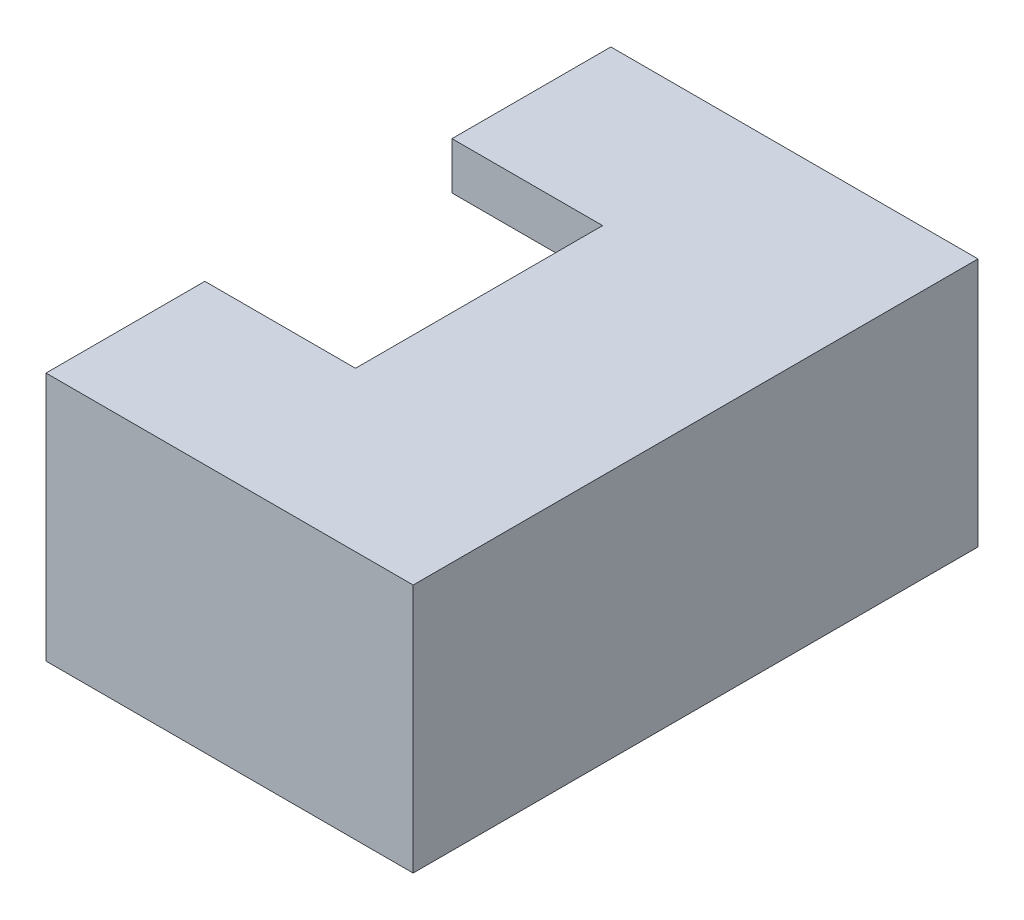
ISO-10303-21;
HEADER;
FILE_DESCRIPTION(('STEP AP214'),'2;1');
FILE_NAME('part.step','',(''),(''),'','','');
FILE_SCHEMA(('AUTOMOTIVE_DESIGN { 1 0 10303 214 1 1 1 1 }'));
ENDSEC;
DATA;
#1=APPLICATION_CONTEXT('core data for automotive mechanical design processes');
#2=APPLICATION_PROTOCOL_DEFINITION('international standard','automotive_design',2000,#1);
#3=PRODUCT_CONTEXT('',#1,'mechanical');
#4=PRODUCT('Part','Part','',(#3));
#5=PRODUCT_RELATED_PRODUCT_CATEGORY('part','',(#4));
#6=PRODUCT_DEFINITION_FORMATION('','',#4);
#7=PRODUCT_DEFINITION_CONTEXT('part definition',#1,'design');
#8=PRODUCT_DEFINITION('design','',#6,#7);
#9=PRODUCT_DEFINITION_SHAPE('','',#8);
#10=(LENGTH_UNIT() NAMED_UNIT(*) SI_UNIT(.MILLI.,.METRE.));
#11=(NAMED_UNIT(*) PLANE_ANGLE_UNIT() SI_UNIT($,.RADIAN.));
#12=(NAMED_UNIT(*) SI_UNIT($,.STERADIAN.) SOLID_ANGLE_UNIT());
#13=UNCERTAINTY_MEASURE_WITH_UNIT(LENGTH_MEASURE(1.E-05),#10,'distance_accuracy_value','');
#14=(GEOMETRIC_REPRESENTATION_CONTEXT(3) GLOBAL_UNCERTAINTY_ASSIGNED_CONTEXT((#13)) GLOBAL_UNIT_ASSIGNED_CONTEXT((#10,
#11,#12)) REPRESENTATION_CONTEXT('',''));
#15=CARTESIAN_POINT('',(0.,0.,0.));
#16=DIRECTION('',(0.,0.,1.));
#17=DIRECTION('',(1.,0.,0.));
#18=AXIS2_PLACEMENT_3D('',#15,#16,#17);
#19=CARTESIAN_POINT('',(7.55,3.4,-3.3));
#20=DIRECTION('',(1.,0.,0.));
#21=DIRECTION('',(0.,0.,-1.));
#22=AXIS2_PLACEMENT_3D('',#19,#20,#21);
#23=PLANE('',#22);
#24=DIRECTION('',(0.,-1.,0.));
#25=VECTOR('',#24,1.);
#26=CARTESIAN_POINT('',(7.55,3.4,-3.6));
#27=LINE('',#26,#25);
#28=CARTESIAN_POINT('',(7.55,3.4,-3.6));
#29=VERTEX_POINT('',#28);
#30=CARTESIAN_POINT('',(7.55,3.1,-3.6));
#31=VERTEX_POINT('',#30);
#32=EDGE_CURVE('P0_E96',#29,#31,#27,.T.);
#33=ORIENTED_EDGE('',*,*,#32,.F.);
#34=DIRECTION('',(0.,0.,-1.));
#35=VECTOR('',#34,1.);
#36=CARTESIAN_POINT('',(7.55,3.4,-3.3));
#37=LINE('',#36,#35);
#38=CARTESIAN_POINT('',(7.55,3.4,-3.3));
#39=VERTEX_POINT('',#38);
#40=EDGE_CURVE('P0_E11',#39,#29,#37,.T.);
#41=ORIENTED_EDGE('',*,*,#40,.F.);
#42=DIRECTION('',(0.,-1.,0.));
#43=VECTOR('',#42,1.);
#44=CARTESIAN_POINT('',(7.55,3.4,-3.3));
#45=LINE('',#44,#43);
#46=CARTESIAN_POINT('',(7.55,3.1,-3.3));
#47=VERTEX_POINT('',#46);
#48=EDGE_CURVE('P0_E90',#39,#47,#45,.T.);
#49=ORIENTED_EDGE('',*,*,#48,.T.);
#50=DIRECTION('',(0.,0.,-1.));
#51=VECTOR('',#50,1.);
#52=CARTESIAN_POINT('',(7.55,3.1,-3.3));
#53=LINE('',#52,#51);
#54=EDGE_CURVE('P0_E35',#47,#31,#53,.T.);
#55=ORIENTED_EDGE('',*,*,#54,.T.);
#56=EDGE_LOOP('',(#33,#41,#49,#55));
#57=FACE_BOUND('',#56,.T.);
#58=ADVANCED_FACE('P0_F32',(#57),#23,.T.);
#59=CARTESIAN_POINT('',(3.55,3.4,-3.3));
#60=DIRECTION('',(0.,1.,0.));
#61=DIRECTION('',(0.,0.,1.));
#62=AXIS2_PLACEMENT_3D('',#59,#60,#61);
#63=PLANE('',#62);
#64=DIRECTION('',(1.,0.,0.));
#65=VECTOR('',#64,1.);
#66=CARTESIAN_POINT('',(3.55,3.4,-3.6));
#67=LINE('',#66,#65);
#68=CARTESIAN_POINT('',(3.55,3.4,-3.6));
#69=VERTEX_POINT('',#68);
#70=EDGE_CURVE('P0_E92',#69,#29,#67,.T.);
#71=ORIENTED_EDGE('',*,*,#70,.F.);
#72=DIRECTION('',(0.,0.,-1.));
#73=VECTOR('',#72,1.);
#74=CARTESIAN_POINT('',(3.55,3.4,-3.3));
#75=LINE('',#74,#73);
#76=CARTESIAN_POINT('',(3.55,3.4,-3.3));
#77=VERTEX_POINT('',#76);
#78=EDGE_CURVE('P0_E41',#77,#69,#75,.T.);
#79=ORIENTED_EDGE('',*,*,#78,.F.);
#80=DIRECTION('',(1.,0.,0.));
#81=VECTOR('',#80,1.);
#82=CARTESIAN_POINT('',(3.55,3.4,-3.3));
#83=LINE('',#82,#81);
#84=EDGE_CURVE('P0_E87',#77,#39,#83,.T.);
#85=ORIENTED_EDGE('',*,*,#84,.T.);
#86=ORIENTED_EDGE('',*,*,#40,.T.);
#87=EDGE_LOOP('',(#71,#79,#85,#86));
#88=FACE_BOUND('',#87,.T.);
#89=ADVANCED_FACE('P0_F106',(#88),#63,.T.);
#90=CARTESIAN_POINT('',(3.55,3.1,-3.3));
#91=DIRECTION('',(-1.,0.,0.));
#92=DIRECTION('',(0.,0.,1.));
#93=AXIS2_PLACEMENT_3D('',#90,#91,#92);
#94=PLANE('',#93);
#95=DIRECTION('',(0.,1.,0.));
#96=VECTOR('',#95,1.);
#97=CARTESIAN_POINT('',(3.55,3.1,-3.6));
#98=LINE('',#97,#96);
#99=CARTESIAN_POINT('',(3.55,3.1,-3.6));
#100=VERTEX_POINT('',#99);
#101=EDGE_CURVE('P0_E82',#100,#69,#98,.T.);
#102=ORIENTED_EDGE('',*,*,#101,.F.);
#103=DIRECTION('',(0.,0.,-1.));
#104=VECTOR('',#103,1.);
#105=CARTESIAN_POINT('',(3.55,3.1,-3.3));
#106=LINE('',#105,#104);
#107=CARTESIAN_POINT('',(3.55,3.1,-3.3));
#108=VERTEX_POINT('',#107);
#109=EDGE_CURVE('P0_E77',#108,#100,#106,.T.);
#110=ORIENTED_EDGE('',*,*,#109,.F.);
#111=DIRECTION('',(0.,1.,0.));
#112=VECTOR('',#111,1.);
#113=CARTESIAN_POINT('',(3.55,3.1,-3.3));
#114=LINE('',#113,#112);
#115=EDGE_CURVE('P0_E80',#108,#77,#114,.T.);
#116=ORIENTED_EDGE('',*,*,#115,.T.);
#117=ORIENTED_EDGE('',*,*,#78,.T.);
#118=EDGE_LOOP('',(#102,#110,#116,#117));
#119=FACE_BOUND('',#118,.T.);
#120=ADVANCED_FACE('P0_F79',(#119),#94,.T.);
#121=CARTESIAN_POINT('',(7.55,3.1,-3.3));
#122=DIRECTION('',(0.,-1.,0.));
#123=DIRECTION('',(0.,0.,-1.));
#124=AXIS2_PLACEMENT_3D('',#121,#122,#123);
#125=PLANE('',#124);
#126=DIRECTION('',(-1.,0.,0.));
#127=VECTOR('',#126,1.);
#128=CARTESIAN_POINT('',(7.55,3.1,-3.6));
#129=LINE('',#128,#127);
#130=EDGE_CURVE('P0_E99',#31,#100,#129,.T.);
#131=ORIENTED_EDGE('',*,*,#130,.F.);
#132=ORIENTED_EDGE('',*,*,#54,.F.);
#133=DIRECTION('',(-1.,0.,0.));
#134=VECTOR('',#133,1.);
#135=CARTESIAN_POINT('',(7.55,3.1,-3.3));
#136=LINE('',#135,#134);
#137=EDGE_CURVE('P0_E86',#47,#108,#136,.T.);
#138=ORIENTED_EDGE('',*,*,#137,.T.);
#139=ORIENTED_EDGE('',*,*,#109,.T.);
#140=EDGE_LOOP('',(#131,#132,#138,#139));
#141=FACE_BOUND('',#140,.T.);
#142=ADVANCED_FACE('P0_F89',(#141),#125,.T.);
#143=CARTESIAN_POINT('',(0.,0.,-3.3));
#144=DIRECTION('',(0.,0.,-1.));
#145=DIRECTION('',(-1.,0.,0.));
#146=AXIS2_PLACEMENT_3D('',#143,#144,#145);
#147=PLANE('',#146);
#148=ORIENTED_EDGE('',*,*,#48,.F.);
#149=ORIENTED_EDGE('',*,*,#84,.F.);
#150=ORIENTED_EDGE('',*,*,#115,.F.);
#151=ORIENTED_EDGE('',*,*,#137,.F.);
#152=EDGE_LOOP('',(#148,#149,#150,#151));
#153=FACE_BOUND('',#152,.T.);
#154=ADVANCED_FACE('P0_F85',(#153),#147,.F.);
#155=CARTESIAN_POINT('',(0.,0.,-3.6));
#156=DIRECTION('',(0.,0.,-1.));
#157=DIRECTION('',(-1.,0.,0.));
#158=AXIS2_PLACEMENT_3D('',#155,#156,#157);
#159=PLANE('',#158);
#160=ORIENTED_EDGE('',*,*,#32,.T.);
#161=ORIENTED_EDGE('',*,*,#130,.T.);
#162=ORIENTED_EDGE('',*,*,#101,.T.);
#163=ORIENTED_EDGE('',*,*,#70,.T.);
#164=EDGE_LOOP('',(#160,#161,#162,#163));
#165=FACE_BOUND('',#164,.T.);
#166=ADVANCED_FACE('P0_F105',(#165),#159,.T.);
#167=CLOSED_SHELL('',(#58,#89,#120,#142,#154,#166));
#168=MANIFOLD_SOLID_BREP('P0_B2',#167);
#169=CARTESIAN_POINT('',(7.55,5.55,-5.5));
#170=DIRECTION('',(0.,1.,0.));
#171=DIRECTION('',(0.,0.,1.));
#172=AXIS2_PLACEMENT_3D('',#169,#170,#171);
#173=PLANE('',#172);
#174=DIRECTION('',(-1.,0.,0.));
#175=VECTOR('',#174,1.);
#176=CARTESIAN_POINT('',(7.55,5.55,-5.5));
#177=LINE('',#176,#175);
#178=CARTESIAN_POINT('',(1.45,5.55,-5.5));
#179=VERTEX_POINT('',#178);
#180=CARTESIAN_POINT('',(7.55,5.55,-5.5));
#181=VERTEX_POINT('',#180);
#182=EDGE_CURVE('P1_E175',#179,#181,#177,.F.);
#183=ORIENTED_EDGE('',*,*,#182,.T.);
#184=DIRECTION('',(0.,0.,-1.));
#185=VECTOR('',#184,1.);
#186=CARTESIAN_POINT('',(7.55,5.55,0.));
#187=LINE('',#186,#185);
#188=CARTESIAN_POINT('',(7.55,5.55,-5.));
#189=VERTEX_POINT('',#188);
#190=EDGE_CURVE('P1_E150',#181,#189,#187,.F.);
#191=ORIENTED_EDGE('',*,*,#190,.T.);
#192=DIRECTION('',(1.,0.,0.));
#193=VECTOR('',#192,1.);
#194=CARTESIAN_POINT('',(7.55,5.55,-5.));
#195=LINE('',#194,#193);
#196=CARTESIAN_POINT('',(1.45,5.55,-5.));
#197=VERTEX_POINT('',#196);
#198=EDGE_CURVE('P1_E160',#189,#197,#195,.F.);
#199=ORIENTED_EDGE('',*,*,#198,.T.);
#200=DIRECTION('',(0.,0.,1.));
#201=VECTOR('',#200,1.);
#202=CARTESIAN_POINT('',(1.45,5.55,-5.5));
#203=LINE('',#202,#201);
#204=EDGE_CURVE('P1_E19',#179,#197,#203,.T.);
#205=ORIENTED_EDGE('',*,*,#204,.F.);
#206=EDGE_LOOP('',(#183,#191,#199,#205));
#207=FACE_BOUND('',#206,.T.);
#208=ADVANCED_FACE('P1_F16',(#207),#173,.F.);
#209=CARTESIAN_POINT('',(7.55,5.55,5.5));
#210=DIRECTION('',(0.,1.,0.));
#211=DIRECTION('',(0.,0.,1.));
#212=AXIS2_PLACEMENT_3D('',#209,#210,#211);
#213=PLANE('',#212);
#214=DIRECTION('',(-1.,0.,0.));
#215=VECTOR('',#214,1.);
#216=CARTESIAN_POINT('',(7.55,5.55,5.));
#217=LINE('',#216,#215);
#218=CARTESIAN_POINT('',(1.45,5.55,5.));
#219=VERTEX_POINT('',#218);
#220=CARTESIAN_POINT('',(7.55,5.55,5.));
#221=VERTEX_POINT('',#220);
#222=EDGE_CURVE('P1_E126',#219,#221,#217,.F.);
#223=ORIENTED_EDGE('',*,*,#222,.T.);
#224=DIRECTION('',(0.,0.,-1.));
#225=VECTOR('',#224,1.);
#226=CARTESIAN_POINT('',(7.55,5.55,0.));
#227=LINE('',#226,#225);
#228=CARTESIAN_POINT('',(7.55,5.55,5.5));
#229=VERTEX_POINT('',#228);
#230=EDGE_CURVE('P1_E155',#221,#229,#227,.F.);
#231=ORIENTED_EDGE('',*,*,#230,.T.);
#232=DIRECTION('',(1.,0.,0.));
#233=VECTOR('',#232,1.);
#234=CARTESIAN_POINT('',(7.55,5.55,5.5));
#235=LINE('',#234,#233);
#236=CARTESIAN_POINT('',(1.45,5.55,5.5));
#237=VERTEX_POINT('',#236);
#238=EDGE_CURVE('P1_E132',#229,#237,#235,.F.);
#239=ORIENTED_EDGE('',*,*,#238,.T.);
#240=DIRECTION('',(0.,0.,1.));
#241=VECTOR('',#240,1.);
#242=CARTESIAN_POINT('',(1.45,5.55,5.5));
#243=LINE('',#242,#241);
#244=EDGE_CURVE('P1_E129',#219,#237,#243,.T.);
#245=ORIENTED_EDGE('',*,*,#244,.F.);
#246=EDGE_LOOP('',(#223,#231,#239,#245));
#247=FACE_BOUND('',#246,.T.);
#248=ADVANCED_FACE('P1_F130',(#247),#213,.F.);
#249=CARTESIAN_POINT('',(7.55,5.55,5.));
#250=DIRECTION('',(0.,0.,-1.));
#251=DIRECTION('',(-1.,0.,0.));
#252=AXIS2_PLACEMENT_3D('',#249,#250,#251);
#253=PLANE('',#252);
#254=DIRECTION('',(1.,0.,0.));
#255=VECTOR('',#254,1.);
#256=CARTESIAN_POINT('',(7.55,5.05,5.));
#257=LINE('',#256,#255);
#258=CARTESIAN_POINT('',(1.45,5.05,5.));
#259=VERTEX_POINT('',#258);
#260=CARTESIAN_POINT('',(7.55,5.05,5.));
#261=VERTEX_POINT('',#260);
#262=EDGE_CURVE('P1_E201',#259,#261,#257,.T.);
#263=ORIENTED_EDGE('',*,*,#262,.T.);
#264=DIRECTION('',(0.,1.,0.));
#265=VECTOR('',#264,1.);
#266=CARTESIAN_POINT('',(7.55,0.,5.));
#267=LINE('',#266,#265);
#268=EDGE_CURVE('P1_E143',#261,#221,#267,.T.);
#269=ORIENTED_EDGE('',*,*,#268,.T.);
#270=ORIENTED_EDGE('',*,*,#222,.F.);
#271=DIRECTION('',(0.,1.,0.));
#272=VECTOR('',#271,1.);
#273=CARTESIAN_POINT('',(1.45,5.55,5.));
#274=LINE('',#273,#272);
#275=EDGE_CURVE('P1_E141',#259,#219,#274,.T.);
#276=ORIENTED_EDGE('',*,*,#275,.F.);
#277=EDGE_LOOP('',(#263,#269,#270,#276));
#278=FACE_BOUND('',#277,.T.);
#279=ADVANCED_FACE('P1_F140',(#278),#253,.F.);
#280=CARTESIAN_POINT('',(7.55,0.,0.));
#281=DIRECTION('',(1.,0.,0.));
#282=DIRECTION('',(0.,0.,-1.));
#283=AXIS2_PLACEMENT_3D('',#280,#281,#282);
#284=PLANE('',#283);
#285=DIRECTION('',(0.,0.,-1.));
#286=VECTOR('',#285,1.);
#287=CARTESIAN_POINT('',(7.55,1.25,-5.5));
#288=LINE('',#287,#286);
#289=CARTESIAN_POINT('',(7.55,1.25,-5.5));
#290=VERTEX_POINT('',#289);
#291=CARTESIAN_POINT('',(7.55,1.25,5.5));
#292=VERTEX_POINT('',#291);
#293=EDGE_CURVE('P1_E183',#290,#292,#288,.F.);
#294=ORIENTED_EDGE('',*,*,#293,.T.);
#295=DIRECTION('',(0.,1.,0.));
#296=VECTOR('',#295,1.);
#297=CARTESIAN_POINT('',(7.55,5.05,5.5));
#298=LINE('',#297,#296);
#299=EDGE_CURVE('P1_E188',#292,#229,#298,.T.);
#300=ORIENTED_EDGE('',*,*,#299,.T.);
#301=ORIENTED_EDGE('',*,*,#230,.F.);
#302=ORIENTED_EDGE('',*,*,#268,.F.);
#303=DIRECTION('',(0.,0.,1.));
#304=VECTOR('',#303,1.);
#305=CARTESIAN_POINT('',(7.55,5.05,-5.));
#306=LINE('',#305,#304);
#307=CARTESIAN_POINT('',(7.55,5.05,-5.));
#308=VERTEX_POINT('',#307);
#309=EDGE_CURVE('P1_E203',#261,#308,#306,.F.);
#310=ORIENTED_EDGE('',*,*,#309,.T.);
#311=DIRECTION('',(0.,1.,0.));
#312=VECTOR('',#311,1.);
#313=CARTESIAN_POINT('',(7.55,5.55,-5.));
#314=LINE('',#313,#312);
#315=EDGE_CURVE('P1_E157',#308,#189,#314,.T.);
#316=ORIENTED_EDGE('',*,*,#315,.T.);
#317=ORIENTED_EDGE('',*,*,#190,.F.);
#318=DIRECTION('',(0.,1.,0.));
#319=VECTOR('',#318,1.);
#320=CARTESIAN_POINT('',(7.55,5.05,-5.5));
#321=LINE('',#320,#319);
#322=EDGE_CURVE('P1_E178',#181,#290,#321,.F.);
#323=ORIENTED_EDGE('',*,*,#322,.T.);
#324=EDGE_LOOP('',(#294,#300,#301,#302,#310,#316,#317,#323));
#325=FACE_BOUND('',#324,.T.);
#326=ADVANCED_FACE('P1_F320',(#325),#284,.F.);
#327=CARTESIAN_POINT('',(7.55,5.55,-5.));
#328=DIRECTION('',(0.,0.,1.));
#329=DIRECTION('',(1.,0.,0.));
#330=AXIS2_PLACEMENT_3D('',#327,#328,#329);
#331=PLANE('',#330);
#332=ORIENTED_EDGE('',*,*,#198,.F.);
#333=ORIENTED_EDGE('',*,*,#315,.F.);
#334=DIRECTION('',(1.,0.,0.));
#335=VECTOR('',#334,1.);
#336=CARTESIAN_POINT('',(7.55,5.05,-5.));
#337=LINE('',#336,#335);
#338=CARTESIAN_POINT('',(1.45,5.05,-5.));
#339=VERTEX_POINT('',#338);
#340=EDGE_CURVE('P1_E206',#308,#339,#337,.F.);
#341=ORIENTED_EDGE('',*,*,#340,.T.);
#342=DIRECTION('',(0.,1.,0.));
#343=VECTOR('',#342,1.);
#344=CARTESIAN_POINT('',(1.45,5.55,-5.));
#345=LINE('',#344,#343);
#346=EDGE_CURVE('P1_E163',#197,#339,#345,.F.);
#347=ORIENTED_EDGE('',*,*,#346,.F.);
#348=EDGE_LOOP('',(#332,#333,#341,#347));
#349=FACE_BOUND('',#348,.T.);
#350=ADVANCED_FACE('P1_F316',(#349),#331,.F.);
#351=CARTESIAN_POINT('',(1.45,1.75,-2.625));
#352=DIRECTION('',(0.,0.,-1.));
#353=DIRECTION('',(-1.,0.,0.));
#354=AXIS2_PLACEMENT_3D('',#351,#352,#353);
#355=PLANE('',#354);
#356=DIRECTION('',(1.,0.,0.));
#357=VECTOR('',#356,1.);
#358=CARTESIAN_POINT('',(7.55,5.05,-2.625));
#359=LINE('',#358,#357);
#360=CARTESIAN_POINT('',(1.45,5.05,-2.625));
#361=VERTEX_POINT('',#360);
#362=CARTESIAN_POINT('',(4.65,5.05,-2.625));
#363=VERTEX_POINT('',#362);
#364=EDGE_CURVE('P1_E192',#361,#363,#359,.T.);
#365=ORIENTED_EDGE('',*,*,#364,.T.);
#366=DIRECTION('',(0.,1.,0.));
#367=VECTOR('',#366,1.);
#368=CARTESIAN_POINT('',(4.65,1.75,-2.625));
#369=LINE('',#368,#367);
#370=CARTESIAN_POINT('',(4.65,6.05,-2.625));
#371=VERTEX_POINT('',#370);
#372=EDGE_CURVE('P1_E167',#363,#371,#369,.T.);
#373=ORIENTED_EDGE('',*,*,#372,.T.);
#374=DIRECTION('',(1.,0.,0.));
#375=VECTOR('',#374,1.);
#376=CARTESIAN_POINT('',(0.,6.05,-2.625));
#377=LINE('',#376,#375);
#378=CARTESIAN_POINT('',(1.45,6.05,-2.625));
#379=VERTEX_POINT('',#378);
#380=EDGE_CURVE('P1_E209',#379,#371,#377,.T.);
#381=ORIENTED_EDGE('',*,*,#380,.F.);
#382=DIRECTION('',(0.,1.,0.));
#383=VECTOR('',#382,1.);
#384=CARTESIAN_POINT('',(1.45,1.75,-2.625));
#385=LINE('',#384,#383);
#386=EDGE_CURVE('P1_E165',#361,#379,#385,.T.);
#387=ORIENTED_EDGE('',*,*,#386,.F.);
#388=EDGE_LOOP('',(#365,#373,#381,#387));
#389=FACE_BOUND('',#388,.T.);
#390=ADVANCED_FACE('P1_F312',(#389),#355,.F.);
#391=CARTESIAN_POINT('',(4.65,1.75,-2.625));
#392=DIRECTION('',(1.,0.,0.));
#393=DIRECTION('',(0.,0.,-1.));
#394=AXIS2_PLACEMENT_3D('',#391,#392,#393);
#395=PLANE('',#394);
#396=DIRECTION('',(0.,0.,1.));
#397=VECTOR('',#396,1.);
#398=CARTESIAN_POINT('',(4.65,5.05,-5.));
#399=LINE('',#398,#397);
#400=CARTESIAN_POINT('',(4.65,5.05,2.625));
#401=VERTEX_POINT('',#400);
#402=EDGE_CURVE('P1_E195',#363,#401,#399,.T.);
#403=ORIENTED_EDGE('',*,*,#402,.T.);
#404=DIRECTION('',(0.,1.,0.));
#405=VECTOR('',#404,1.);
#406=CARTESIAN_POINT('',(4.65,1.75,2.625));
#407=LINE('',#406,#405);
#408=CARTESIAN_POINT('',(4.65,6.05,2.625));
#409=VERTEX_POINT('',#408);
#410=EDGE_CURVE('P1_E172',#401,#409,#407,.T.);
#411=ORIENTED_EDGE('',*,*,#410,.T.);
#412=DIRECTION('',(0.,0.,1.));
#413=VECTOR('',#412,1.);
#414=CARTESIAN_POINT('',(4.65,6.05,0.));
#415=LINE('',#414,#413);
#416=EDGE_CURVE('P1_E211',#371,#409,#415,.T.);
#417=ORIENTED_EDGE('',*,*,#416,.F.);
#418=ORIENTED_EDGE('',*,*,#372,.F.);
#419=EDGE_LOOP('',(#403,#411,#417,#418));
#420=FACE_BOUND('',#419,.T.);
#421=ADVANCED_FACE('P1_F308',(#420),#395,.F.);
#422=CARTESIAN_POINT('',(1.45,1.75,2.625));
#423=DIRECTION('',(0.,0.,1.));
#424=DIRECTION('',(1.,0.,0.));
#425=AXIS2_PLACEMENT_3D('',#422,#423,#424);
#426=PLANE('',#425);
#427=DIRECTION('',(1.,0.,0.));
#428=VECTOR('',#427,1.);
#429=CARTESIAN_POINT('',(7.55,5.05,2.625));
#430=LINE('',#429,#428);
#431=CARTESIAN_POINT('',(1.45,5.05,2.625));
#432=VERTEX_POINT('',#431);
#433=EDGE_CURVE('P1_E198',#401,#432,#430,.F.);
#434=ORIENTED_EDGE('',*,*,#433,.T.);
#435=DIRECTION('',(0.,1.,0.));
#436=VECTOR('',#435,1.);
#437=CARTESIAN_POINT('',(1.45,1.75,2.625));
#438=LINE('',#437,#436);
#439=CARTESIAN_POINT('',(1.45,6.05,2.625));
#440=VERTEX_POINT('',#439);
#441=EDGE_CURVE('P1_E170',#440,#432,#438,.F.);
#442=ORIENTED_EDGE('',*,*,#441,.F.);
#443=DIRECTION('',(1.,0.,0.));
#444=VECTOR('',#443,1.);
#445=CARTESIAN_POINT('',(0.,6.05,2.625));
#446=LINE('',#445,#444);
#447=EDGE_CURVE('P1_E213',#409,#440,#446,.F.);
#448=ORIENTED_EDGE('',*,*,#447,.F.);
#449=ORIENTED_EDGE('',*,*,#410,.F.);
#450=EDGE_LOOP('',(#434,#442,#448,#449));
#451=FACE_BOUND('',#450,.T.);
#452=ADVANCED_FACE('P1_F304',(#451),#426,.F.);
#453=CARTESIAN_POINT('',(7.55,5.05,-5.5));
#454=DIRECTION('',(0.,0.,-1.));
#455=DIRECTION('',(-1.,0.,0.));
#456=AXIS2_PLACEMENT_3D('',#453,#454,#455);
#457=PLANE('',#456);
#458=DIRECTION('',(1.,0.,0.));
#459=VECTOR('',#458,1.);
#460=CARTESIAN_POINT('',(7.55,1.25,-5.5));
#461=LINE('',#460,#459);
#462=CARTESIAN_POINT('',(1.45,1.25,-5.5));
#463=VERTEX_POINT('',#462);
#464=EDGE_CURVE('P1_E180',#463,#290,#461,.T.);
#465=ORIENTED_EDGE('',*,*,#464,.T.);
#466=ORIENTED_EDGE('',*,*,#322,.F.);
#467=ORIENTED_EDGE('',*,*,#182,.F.);
#468=DIRECTION('',(0.,1.,0.));
#469=VECTOR('',#468,1.);
#470=CARTESIAN_POINT('',(1.45,6.05,-5.5));
#471=LINE('',#470,#469);
#472=EDGE_CURVE('P1_E218',#179,#463,#471,.F.);
#473=ORIENTED_EDGE('',*,*,#472,.T.);
#474=EDGE_LOOP('',(#465,#466,#467,#473));
#475=FACE_BOUND('',#474,.T.);
#476=ADVANCED_FACE('P1_F300',(#475),#457,.F.);
#477=CARTESIAN_POINT('',(7.55,1.25,-5.5));
#478=DIRECTION('',(0.,-1.,0.));
#479=DIRECTION('',(0.,0.,-1.));
#480=AXIS2_PLACEMENT_3D('',#477,#478,#479);
#481=PLANE('',#480);
#482=DIRECTION('',(1.,0.,0.));
#483=VECTOR('',#482,1.);
#484=CARTESIAN_POINT('',(7.55,1.25,5.5));
#485=LINE('',#484,#483);
#486=CARTESIAN_POINT('',(1.45,1.25,5.5));
#487=VERTEX_POINT('',#486);
#488=EDGE_CURVE('P1_E185',#487,#292,#485,.T.);
#489=ORIENTED_EDGE('',*,*,#488,.T.);
#490=ORIENTED_EDGE('',*,*,#293,.F.);
#491=ORIENTED_EDGE('',*,*,#464,.F.);
#492=DIRECTION('',(0.,0.,-1.));
#493=VECTOR('',#492,1.);
#494=CARTESIAN_POINT('',(1.45,1.25,-6.));
#495=LINE('',#494,#493);
#496=EDGE_CURVE('P1_E221',#463,#487,#495,.F.);
#497=ORIENTED_EDGE('',*,*,#496,.T.);
#498=EDGE_LOOP('',(#489,#490,#491,#497));
#499=FACE_BOUND('',#498,.T.);
#500=ADVANCED_FACE('P1_F296',(#499),#481,.F.);
#501=CARTESIAN_POINT('',(7.55,5.05,5.5));
#502=DIRECTION('',(0.,0.,1.));
#503=DIRECTION('',(1.,0.,0.));
#504=AXIS2_PLACEMENT_3D('',#501,#502,#503);
#505=PLANE('',#504);
#506=ORIENTED_EDGE('',*,*,#238,.F.);
#507=ORIENTED_EDGE('',*,*,#299,.F.);
#508=ORIENTED_EDGE('',*,*,#488,.F.);
#509=DIRECTION('',(0.,1.,0.));
#510=VECTOR('',#509,1.);
#511=CARTESIAN_POINT('',(1.45,6.05,5.5));
#512=LINE('',#511,#510);
#513=EDGE_CURVE('P1_E224',#487,#237,#512,.T.);
#514=ORIENTED_EDGE('',*,*,#513,.T.);
#515=EDGE_LOOP('',(#506,#507,#508,#514));
#516=FACE_BOUND('',#515,.T.);
#517=ADVANCED_FACE('P1_F292',(#516),#505,.F.);
#518=CARTESIAN_POINT('',(7.55,5.05,-5.));
#519=DIRECTION('',(0.,1.,0.));
#520=DIRECTION('',(0.,0.,1.));
#521=AXIS2_PLACEMENT_3D('',#518,#519,#520);
#522=PLANE('',#521);
#523=ORIENTED_EDGE('',*,*,#340,.F.);
#524=ORIENTED_EDGE('',*,*,#309,.F.);
#525=ORIENTED_EDGE('',*,*,#262,.F.);
#526=DIRECTION('',(0.,0.,-1.));
#527=VECTOR('',#526,1.);
#528=CARTESIAN_POINT('',(1.45,5.05,-6.));
#529=LINE('',#528,#527);
#530=EDGE_CURVE('P1_E149',#259,#432,#529,.T.);
#531=ORIENTED_EDGE('',*,*,#530,.T.);
#532=ORIENTED_EDGE('',*,*,#433,.F.);
#533=ORIENTED_EDGE('',*,*,#402,.F.);
#534=ORIENTED_EDGE('',*,*,#364,.F.);
#535=DIRECTION('',(0.,0.,-1.));
#536=VECTOR('',#535,1.);
#537=CARTESIAN_POINT('',(1.45,5.05,-6.));
#538=LINE('',#537,#536);
#539=EDGE_CURVE('P1_E235',#361,#339,#538,.T.);
#540=ORIENTED_EDGE('',*,*,#539,.T.);
#541=EDGE_LOOP('',(#523,#524,#525,#531,#532,#533,#534,#540));
#542=FACE_BOUND('',#541,.T.);
#543=ADVANCED_FACE('P1_F288',(#542),#522,.F.);
#544=CARTESIAN_POINT('',(0.,6.05,0.));
#545=DIRECTION('',(0.,1.,0.));
#546=DIRECTION('',(0.,0.,1.));
#547=AXIS2_PLACEMENT_3D('',#544,#545,#546);
#548=PLANE('',#547);
#549=DIRECTION('',(1.,0.,0.));
#550=VECTOR('',#549,1.);
#551=CARTESIAN_POINT('',(1.45,6.05,-6.));
#552=LINE('',#551,#550);
#553=CARTESIAN_POINT('',(9.25,6.05,-6.));
#554=VERTEX_POINT('',#553);
#555=CARTESIAN_POINT('',(1.45,6.05,-6.));
#556=VERTEX_POINT('',#555);
#557=EDGE_CURVE('P1_E216',#554,#556,#552,.F.);
#558=ORIENTED_EDGE('',*,*,#557,.T.);
#559=DIRECTION('',(0.,0.,-1.));
#560=VECTOR('',#559,1.);
#561=CARTESIAN_POINT('',(1.45,6.05,-6.));
#562=LINE('',#561,#560);
#563=EDGE_CURVE('P1_E232',#556,#379,#562,.F.);
#564=ORIENTED_EDGE('',*,*,#563,.T.);
#565=ORIENTED_EDGE('',*,*,#380,.T.);
#566=ORIENTED_EDGE('',*,*,#416,.T.);
#567=ORIENTED_EDGE('',*,*,#447,.T.);
#568=DIRECTION('',(0.,0.,-1.));
#569=VECTOR('',#568,1.);
#570=CARTESIAN_POINT('',(1.45,6.05,-6.));
#571=LINE('',#570,#569);
#572=CARTESIAN_POINT('',(1.45,6.05,6.));
#573=VERTEX_POINT('',#572);
#574=EDGE_CURVE('P1_E227',#440,#573,#571,.F.);
#575=ORIENTED_EDGE('',*,*,#574,.T.);
#576=DIRECTION('',(-1.,0.,0.));
#577=VECTOR('',#576,1.);
#578=CARTESIAN_POINT('',(1.45,6.05,6.));
#579=LINE('',#578,#577);
#580=CARTESIAN_POINT('',(9.25,6.05,6.));
#581=VERTEX_POINT('',#580);
#582=EDGE_CURVE('P1_E241',#573,#581,#579,.F.);
#583=ORIENTED_EDGE('',*,*,#582,.T.);
#584=DIRECTION('',(0.,0.,1.));
#585=VECTOR('',#584,1.);
#586=CARTESIAN_POINT('',(9.25,6.05,-6.));
#587=LINE('',#586,#585);
#588=EDGE_CURVE('P1_E244',#581,#554,#587,.F.);
#589=ORIENTED_EDGE('',*,*,#588,.T.);
#590=EDGE_LOOP('',(#558,#564,#565,#566,#567,#575,#583,#589));
#591=FACE_BOUND('',#590,.T.);
#592=ADVANCED_FACE('P1_F285',(#591),#548,.T.);
#593=CARTESIAN_POINT('',(1.45,6.05,-6.));
#594=DIRECTION('',(0.,0.,1.));
#595=DIRECTION('',(1.,0.,0.));
#596=AXIS2_PLACEMENT_3D('',#593,#594,#595);
#597=PLANE('',#596);
#598=DIRECTION('',(0.,1.,0.));
#599=VECTOR('',#598,1.);
#600=CARTESIAN_POINT('',(1.45,6.05,-6.));
#601=LINE('',#600,#599);
#602=CARTESIAN_POINT('',(1.45,0.75,-6.));
#603=VERTEX_POINT('',#602);
#604=EDGE_CURVE('P1_E229',#603,#556,#601,.T.);
#605=ORIENTED_EDGE('',*,*,#604,.T.);
#606=ORIENTED_EDGE('',*,*,#557,.F.);
#607=DIRECTION('',(0.,1.,0.));
#608=VECTOR('',#607,1.);
#609=CARTESIAN_POINT('',(9.25,6.05,-6.));
#610=LINE('',#609,#608);
#611=CARTESIAN_POINT('',(9.25,0.75,-6.));
#612=VERTEX_POINT('',#611);
#613=EDGE_CURVE('P1_E247',#554,#612,#610,.F.);
#614=ORIENTED_EDGE('',*,*,#613,.T.);
#615=DIRECTION('',(1.,0.,0.));
#616=VECTOR('',#615,1.);
#617=CARTESIAN_POINT('',(0.,0.75,-6.));
#618=LINE('',#617,#616);
#619=EDGE_CURVE('P1_E250',#612,#603,#618,.F.);
#620=ORIENTED_EDGE('',*,*,#619,.T.);
#621=EDGE_LOOP('',(#605,#606,#614,#620));
#622=FACE_BOUND('',#621,.T.);
#623=ADVANCED_FACE('P1_F267',(#622),#597,.F.);
#624=CARTESIAN_POINT('',(1.45,6.05,-6.));
#625=DIRECTION('',(1.,0.,0.));
#626=DIRECTION('',(0.,0.,-1.));
#627=AXIS2_PLACEMENT_3D('',#624,#625,#626);
#628=PLANE('',#627);
#629=ORIENTED_EDGE('',*,*,#539,.F.);
#630=ORIENTED_EDGE('',*,*,#386,.T.);
#631=ORIENTED_EDGE('',*,*,#563,.F.);
#632=ORIENTED_EDGE('',*,*,#604,.F.);
#633=DIRECTION('',(0.,0.,1.));
#634=VECTOR('',#633,1.);
#635=CARTESIAN_POINT('',(1.45,0.75,0.));
#636=LINE('',#635,#634);
#637=CARTESIAN_POINT('',(1.45,0.75,6.));
#638=VERTEX_POINT('',#637);
#639=EDGE_CURVE('P1_E253',#603,#638,#636,.T.);
#640=ORIENTED_EDGE('',*,*,#639,.T.);
#641=DIRECTION('',(0.,1.,0.));
#642=VECTOR('',#641,1.);
#643=CARTESIAN_POINT('',(1.45,6.05,6.));
#644=LINE('',#643,#642);
#645=EDGE_CURVE('P1_E238',#638,#573,#644,.T.);
#646=ORIENTED_EDGE('',*,*,#645,.T.);
#647=ORIENTED_EDGE('',*,*,#574,.F.);
#648=ORIENTED_EDGE('',*,*,#441,.T.);
#649=ORIENTED_EDGE('',*,*,#530,.F.);
#650=ORIENTED_EDGE('',*,*,#275,.T.);
#651=ORIENTED_EDGE('',*,*,#244,.T.);
#652=ORIENTED_EDGE('',*,*,#513,.F.);
#653=ORIENTED_EDGE('',*,*,#496,.F.);
#654=ORIENTED_EDGE('',*,*,#472,.F.);
#655=ORIENTED_EDGE('',*,*,#204,.T.);
#656=ORIENTED_EDGE('',*,*,#346,.T.);
#657=EDGE_LOOP('',(#629,#630,#631,#632,#640,#646,#647,#648,#649,#650,#651,#652,#653,#654,#655,#656));
#658=FACE_BOUND('',#657,.T.);
#659=ADVANCED_FACE('P1_F147',(#658),#628,.F.);
#660=CARTESIAN_POINT('',(1.45,6.05,6.));
#661=DIRECTION('',(0.,0.,-1.));
#662=DIRECTION('',(-1.,0.,0.));
#663=AXIS2_PLACEMENT_3D('',#660,#661,#662);
#664=PLANE('',#663);
#665=DIRECTION('',(0.,1.,0.));
#666=VECTOR('',#665,1.);
#667=CARTESIAN_POINT('',(9.25,6.05,6.));
#668=LINE('',#667,#666);
#669=CARTESIAN_POINT('',(9.25,0.75,6.));
#670=VERTEX_POINT('',#669);
#671=EDGE_CURVE('P1_E33',#670,#581,#668,.T.);
#672=ORIENTED_EDGE('',*,*,#671,.T.);
#673=ORIENTED_EDGE('',*,*,#582,.F.);
#674=ORIENTED_EDGE('',*,*,#645,.F.);
#675=DIRECTION('',(1.,0.,0.));
#676=VECTOR('',#675,1.);
#677=CARTESIAN_POINT('',(0.,0.75,6.));
#678=LINE('',#677,#676);
#679=EDGE_CURVE('P1_E25',#638,#670,#678,.T.);
#680=ORIENTED_EDGE('',*,*,#679,.T.);
#681=EDGE_LOOP('',(#672,#673,#674,#680));
#682=FACE_BOUND('',#681,.T.);
#683=ADVANCED_FACE('P1_F259',(#682),#664,.F.);
#684=CARTESIAN_POINT('',(9.25,6.05,-6.));
#685=DIRECTION('',(-1.,0.,0.));
#686=DIRECTION('',(0.,0.,1.));
#687=AXIS2_PLACEMENT_3D('',#684,#685,#686);
#688=PLANE('',#687);
#689=ORIENTED_EDGE('',*,*,#613,.F.);
#690=ORIENTED_EDGE('',*,*,#588,.F.);
#691=ORIENTED_EDGE('',*,*,#671,.F.);
#692=DIRECTION('',(0.,0.,1.));
#693=VECTOR('',#692,1.);
#694=CARTESIAN_POINT('',(9.25,0.75,0.));
#695=LINE('',#694,#693);
#696=EDGE_CURVE('P1_E11',#670,#612,#695,.F.);
#697=ORIENTED_EDGE('',*,*,#696,.T.);
#698=EDGE_LOOP('',(#689,#690,#691,#697));
#699=FACE_BOUND('',#698,.T.);
#700=ADVANCED_FACE('P1_F269',(#699),#688,.F.);
#701=CARTESIAN_POINT('',(0.,0.75,0.));
#702=DIRECTION('',(0.,1.,0.));
#703=DIRECTION('',(0.,0.,1.));
#704=AXIS2_PLACEMENT_3D('',#701,#702,#703);
#705=PLANE('',#704);
#706=ORIENTED_EDGE('',*,*,#679,.F.);
#707=ORIENTED_EDGE('',*,*,#639,.F.);
#708=ORIENTED_EDGE('',*,*,#619,.F.);
#709=ORIENTED_EDGE('',*,*,#696,.F.);
#710=EDGE_LOOP('',(#706,#707,#708,#709));
#711=FACE_BOUND('',#710,.T.);
#712=ADVANCED_FACE('P1_F263',(#711),#705,.F.);
#713=CLOSED_SHELL('',(#208,#248,#279,#326,#350,#390,#421,#452,#476,#500,#517,#543,#592,#623,
#659,#683,#700,#712));
#714=MANIFOLD_SOLID_BREP('P1_B1',#713);
#715=CARTESIAN_POINT('',(3.55000000000001,3.4,3.3));
#716=DIRECTION('',(0.,-1.,0.));
#717=DIRECTION('',(0.,0.,-1.));
#718=AXIS2_PLACEMENT_3D('',#715,#716,#717);
#719=PLANE('',#718);
#720=DIRECTION('',(1.,0.,0.));
#721=VECTOR('',#720,1.);
#722=CARTESIAN_POINT('',(3.55000000000001,3.4,3.3));
#723=LINE('',#722,#721);
#724=CARTESIAN_POINT('',(7.55,3.4,3.3));
#725=VERTEX_POINT('',#724);
#726=CARTESIAN_POINT('',(3.55000000000001,3.4,3.3));
#727=VERTEX_POINT('',#726);
#728=EDGE_CURVE('P2_E64',#725,#727,#723,.F.);
#729=ORIENTED_EDGE('',*,*,#728,.T.);
#730=DIRECTION('',(0.,0.,1.));
#731=VECTOR('',#730,1.);
#732=CARTESIAN_POINT('',(3.55000000000001,3.4,0.));
#733=LINE('',#732,#731);
#734=CARTESIAN_POINT('',(3.55000000000001,3.4,3.6));
#735=VERTEX_POINT('',#734);
#736=EDGE_CURVE('P2_E54',#735,#727,#733,.F.);
#737=ORIENTED_EDGE('',*,*,#736,.F.);
#738=DIRECTION('',(-1.,0.,0.));
#739=VECTOR('',#738,1.);
#740=CARTESIAN_POINT('',(3.55000000000001,3.4,3.6));
#741=LINE('',#740,#739);
#742=CARTESIAN_POINT('',(7.55,3.4,3.6));
#743=VERTEX_POINT('',#742);
#744=EDGE_CURVE('P2_E74',#735,#743,#741,.F.);
#745=ORIENTED_EDGE('',*,*,#744,.T.);
#746=DIRECTION('',(0.,0.,-1.));
#747=VECTOR('',#746,1.);
#748=CARTESIAN_POINT('',(7.55,3.4,3.3));
#749=LINE('',#748,#747);
#750=EDGE_CURVE('P2_E19',#725,#743,#749,.F.);
#751=ORIENTED_EDGE('',*,*,#750,.F.);
#752=EDGE_LOOP('',(#729,#737,#745,#751));
#753=FACE_BOUND('',#752,.T.);
#754=ADVANCED_FACE('P2_F16',(#753),#719,.F.);
#755=CARTESIAN_POINT('',(3.55000000000001,3.4,3.3));
#756=DIRECTION('',(0.,0.,1.));
#757=DIRECTION('',(1.,0.,0.));
#758=AXIS2_PLACEMENT_3D('',#755,#756,#757);
#759=PLANE('',#758);
#760=DIRECTION('',(1.,0.,0.));
#761=VECTOR('',#760,1.);
#762=CARTESIAN_POINT('',(3.55000000000001,3.1,3.3));
#763=LINE('',#762,#761);
#764=CARTESIAN_POINT('',(7.55,3.1,3.3));
#765=VERTEX_POINT('',#764);
#766=CARTESIAN_POINT('',(3.55000000000001,3.1,3.3));
#767=VERTEX_POINT('',#766);
#768=EDGE_CURVE('P2_E72',#765,#767,#763,.F.);
#769=ORIENTED_EDGE('',*,*,#768,.T.);
#770=DIRECTION('',(0.,1.,0.));
#771=VECTOR('',#770,1.);
#772=CARTESIAN_POINT('',(3.55000000000001,0.,3.3));
#773=LINE('',#772,#771);
#774=EDGE_CURVE('P2_E61',#727,#767,#773,.F.);
#775=ORIENTED_EDGE('',*,*,#774,.F.);
#776=ORIENTED_EDGE('',*,*,#728,.F.);
#777=DIRECTION('',(0.,1.,0.));
#778=VECTOR('',#777,1.);
#779=CARTESIAN_POINT('',(7.55,0.,3.3));
#780=LINE('',#779,#778);
#781=EDGE_CURVE('P2_E78',#725,#765,#780,.F.);
#782=ORIENTED_EDGE('',*,*,#781,.T.);
#783=EDGE_LOOP('',(#769,#775,#776,#782));
#784=FACE_BOUND('',#783,.T.);
#785=ADVANCED_FACE('P2_F71',(#784),#759,.F.);
#786=CARTESIAN_POINT('',(3.55000000000001,0.,0.));
#787=DIRECTION('',(-1.,0.,0.));
#788=DIRECTION('',(0.,0.,1.));
#789=AXIS2_PLACEMENT_3D('',#786,#787,#788);
#790=PLANE('',#789);
#791=ORIENTED_EDGE('',*,*,#774,.T.);
#792=DIRECTION('',(0.,0.,1.));
#793=VECTOR('',#792,1.);
#794=CARTESIAN_POINT('',(3.55000000000001,3.1,3.3));
#795=LINE('',#794,#793);
#796=CARTESIAN_POINT('',(3.55000000000001,3.1,3.6));
#797=VERTEX_POINT('',#796);
#798=EDGE_CURVE('P2_E82',#767,#797,#795,.T.);
#799=ORIENTED_EDGE('',*,*,#798,.T.);
#800=DIRECTION('',(0.,1.,0.));
#801=VECTOR('',#800,1.);
#802=CARTESIAN_POINT('',(3.55000000000001,3.4,3.6));
#803=LINE('',#802,#801);
#804=EDGE_CURVE('P2_E63',#797,#735,#803,.T.);
#805=ORIENTED_EDGE('',*,*,#804,.T.);
#806=ORIENTED_EDGE('',*,*,#736,.T.);
#807=EDGE_LOOP('',(#791,#799,#805,#806));
#808=FACE_BOUND('',#807,.T.);
#809=ADVANCED_FACE('P2_F58',(#808),#790,.T.);
#810=CARTESIAN_POINT('',(3.55000000000001,3.4,3.6));
#811=DIRECTION('',(0.,0.,-1.));
#812=DIRECTION('',(-1.,0.,0.));
#813=AXIS2_PLACEMENT_3D('',#810,#811,#812);
#814=PLANE('',#813);
#815=ORIENTED_EDGE('',*,*,#744,.F.);
#816=ORIENTED_EDGE('',*,*,#804,.F.);
#817=DIRECTION('',(1.,0.,0.));
#818=VECTOR('',#817,1.);
#819=CARTESIAN_POINT('',(3.55000000000001,3.1,3.6));
#820=LINE('',#819,#818);
#821=CARTESIAN_POINT('',(7.55,3.1,3.6));
#822=VERTEX_POINT('',#821);
#823=EDGE_CURVE('P2_E25',#797,#822,#820,.T.);
#824=ORIENTED_EDGE('',*,*,#823,.T.);
#825=DIRECTION('',(0.,1.,0.));
#826=VECTOR('',#825,1.);
#827=CARTESIAN_POINT('',(7.55,0.,3.6));
#828=LINE('',#827,#826);
#829=EDGE_CURVE('P2_E33',#822,#743,#828,.T.);
#830=ORIENTED_EDGE('',*,*,#829,.T.);
#831=EDGE_LOOP('',(#815,#816,#824,#830));
#832=FACE_BOUND('',#831,.T.);
#833=ADVANCED_FACE('P2_F87',(#832),#814,.F.);
#834=CARTESIAN_POINT('',(7.55,0.,0.));
#835=DIRECTION('',(-1.,0.,0.));
#836=DIRECTION('',(0.,0.,1.));
#837=AXIS2_PLACEMENT_3D('',#834,#835,#836);
#838=PLANE('',#837);
#839=DIRECTION('',(0.,0.,1.));
#840=VECTOR('',#839,1.);
#841=CARTESIAN_POINT('',(7.55,3.1,3.3));
#842=LINE('',#841,#840);
#843=EDGE_CURVE('P2_E11',#822,#765,#842,.F.);
#844=ORIENTED_EDGE('',*,*,#843,.T.);
#845=ORIENTED_EDGE('',*,*,#781,.F.);
#846=ORIENTED_EDGE('',*,*,#750,.T.);
#847=ORIENTED_EDGE('',*,*,#829,.F.);
#848=EDGE_LOOP('',(#844,#845,#846,#847));
#849=FACE_BOUND('',#848,.T.);
#850=ADVANCED_FACE('P2_F90',(#849),#838,.F.);
#851=CARTESIAN_POINT('',(3.55000000000001,3.1,3.3));
#852=DIRECTION('',(0.,1.,0.));
#853=DIRECTION('',(0.,0.,1.));
#854=AXIS2_PLACEMENT_3D('',#851,#852,#853);
#855=PLANE('',#854);
#856=ORIENTED_EDGE('',*,*,#823,.F.);
#857=ORIENTED_EDGE('',*,*,#798,.F.);
#858=ORIENTED_EDGE('',*,*,#768,.F.);
#859=ORIENTED_EDGE('',*,*,#843,.F.);
#860=EDGE_LOOP('',(#856,#857,#858,#859));
#861=FACE_BOUND('',#860,.T.);
#862=ADVANCED_FACE('P2_F89',(#861),#855,.F.);
#863=CLOSED_SHELL('',(#754,#785,#809,#833,#850,#862));
#864=MANIFOLD_SOLID_BREP('P2_B1',#863);
#865=CARTESIAN_POINT('',(3.55,3.4,1.));
#866=DIRECTION('',(0.,-1.,0.));
#867=DIRECTION('',(0.,0.,-1.));
#868=AXIS2_PLACEMENT_3D('',#865,#866,#867);
#869=PLANE('',#868);
#870=DIRECTION('',(1.,0.,0.));
#871=VECTOR('',#870,1.);
#872=CARTESIAN_POINT('',(3.55,3.4,1.));
#873=LINE('',#872,#871);
#874=CARTESIAN_POINT('',(7.55,3.4,1.));
#875=VERTEX_POINT('',#874);
#876=CARTESIAN_POINT('',(3.55,3.4,1.));
#877=VERTEX_POINT('',#876);
#878=EDGE_CURVE('P3_E64',#875,#877,#873,.F.);
#879=ORIENTED_EDGE('',*,*,#878,.T.);
#880=DIRECTION('',(0.,0.,1.));
#881=VECTOR('',#880,1.);
#882=CARTESIAN_POINT('',(3.55,3.4,0.));
#883=LINE('',#882,#881);
#884=CARTESIAN_POINT('',(3.55,3.4,1.3));
#885=VERTEX_POINT('',#884);
#886=EDGE_CURVE('P3_E54',#885,#877,#883,.F.);
#887=ORIENTED_EDGE('',*,*,#886,.F.);
#888=DIRECTION('',(-1.,0.,0.));
#889=VECTOR('',#888,1.);
#890=CARTESIAN_POINT('',(3.55,3.4,1.3));
#891=LINE('',#890,#889);
#892=CARTESIAN_POINT('',(7.55,3.4,1.3));
#893=VERTEX_POINT('',#892);
#894=EDGE_CURVE('P3_E74',#885,#893,#891,.F.);
#895=ORIENTED_EDGE('',*,*,#894,.T.);
#896=DIRECTION('',(0.,0.,-1.));
#897=VECTOR('',#896,1.);
#898=CARTESIAN_POINT('',(7.55,3.4,1.));
#899=LINE('',#898,#897);
#900=EDGE_CURVE('P3_E19',#875,#893,#899,.F.);
#901=ORIENTED_EDGE('',*,*,#900,.F.);
#902=EDGE_LOOP('',(#879,#887,#895,#901));
#903=FACE_BOUND('',#902,.T.);
#904=ADVANCED_FACE('P3_F16',(#903),#869,.F.);
#905=CARTESIAN_POINT('',(3.55,3.4,1.));
#906=DIRECTION('',(0.,0.,1.));
#907=DIRECTION('',(1.,0.,0.));
#908=AXIS2_PLACEMENT_3D('',#905,#906,#907);
#909=PLANE('',#908);
#910=DIRECTION('',(1.,0.,0.));
#911=VECTOR('',#910,1.);
#912=CARTESIAN_POINT('',(3.55,3.1,0.999999999999999));
#913=LINE('',#912,#911);
#914=CARTESIAN_POINT('',(7.55,3.1,0.999999999999999));
#915=VERTEX_POINT('',#914);
#916=CARTESIAN_POINT('',(3.55,3.1,1.));
#917=VERTEX_POINT('',#916);
#918=EDGE_CURVE('P3_E72',#915,#917,#913,.F.);
#919=ORIENTED_EDGE('',*,*,#918,.T.);
#920=DIRECTION('',(0.,1.,0.));
#921=VECTOR('',#920,1.);
#922=CARTESIAN_POINT('',(3.55,0.,1.));
#923=LINE('',#922,#921);
#924=EDGE_CURVE('P3_E61',#877,#917,#923,.F.);
#925=ORIENTED_EDGE('',*,*,#924,.F.);
#926=ORIENTED_EDGE('',*,*,#878,.F.);
#927=DIRECTION('',(0.,1.,0.));
#928=VECTOR('',#927,1.);
#929=CARTESIAN_POINT('',(7.55,0.,0.999999999999999));
#930=LINE('',#929,#928);
#931=EDGE_CURVE('P3_E78',#875,#915,#930,.F.);
#932=ORIENTED_EDGE('',*,*,#931,.T.);
#933=EDGE_LOOP('',(#919,#925,#926,#932));
#934=FACE_BOUND('',#933,.T.);
#935=ADVANCED_FACE('P3_F71',(#934),#909,.F.);
#936=CARTESIAN_POINT('',(3.55,0.,0.));
#937=DIRECTION('',(-1.,0.,0.));
#938=DIRECTION('',(0.,0.,1.));
#939=AXIS2_PLACEMENT_3D('',#936,#937,#938);
#940=PLANE('',#939);
#941=ORIENTED_EDGE('',*,*,#924,.T.);
#942=DIRECTION('',(0.,0.,1.));
#943=VECTOR('',#942,1.);
#944=CARTESIAN_POINT('',(3.55,3.1,1.));
#945=LINE('',#944,#943);
#946=CARTESIAN_POINT('',(3.55,3.1,1.3));
#947=VERTEX_POINT('',#946);
#948=EDGE_CURVE('P3_E82',#917,#947,#945,.T.);
#949=ORIENTED_EDGE('',*,*,#948,.T.);
#950=DIRECTION('',(0.,1.,0.));
#951=VECTOR('',#950,1.);
#952=CARTESIAN_POINT('',(3.55,3.4,1.3));
#953=LINE('',#952,#951);
#954=EDGE_CURVE('P3_E63',#947,#885,#953,.T.);
#955=ORIENTED_EDGE('',*,*,#954,.T.);
#956=ORIENTED_EDGE('',*,*,#886,.T.);
#957=EDGE_LOOP('',(#941,#949,#955,#956));
#958=FACE_BOUND('',#957,.T.);
#959=ADVANCED_FACE('P3_F58',(#958),#940,.T.);
#960=CARTESIAN_POINT('',(3.55,3.4,1.3));
#961=DIRECTION('',(0.,0.,-1.));
#962=DIRECTION('',(-1.,0.,0.));
#963=AXIS2_PLACEMENT_3D('',#960,#961,#962);
#964=PLANE('',#963);
#965=ORIENTED_EDGE('',*,*,#894,.F.);
#966=ORIENTED_EDGE('',*,*,#954,.F.);
#967=DIRECTION('',(1.,0.,0.));
#968=VECTOR('',#967,1.);
#969=CARTESIAN_POINT('',(3.55,3.1,1.3));
#970=LINE('',#969,#968);
#971=CARTESIAN_POINT('',(7.55,3.1,1.3));
#972=VERTEX_POINT('',#971);
#973=EDGE_CURVE('P3_E25',#947,#972,#970,.T.);
#974=ORIENTED_EDGE('',*,*,#973,.T.);
#975=DIRECTION('',(0.,1.,0.));
#976=VECTOR('',#975,1.);
#977=CARTESIAN_POINT('',(7.55,0.,1.3));
#978=LINE('',#977,#976);
#979=EDGE_CURVE('P3_E33',#972,#893,#978,.T.);
#980=ORIENTED_EDGE('',*,*,#979,.T.);
#981=EDGE_LOOP('',(#965,#966,#974,#980));
#982=FACE_BOUND('',#981,.T.);
#983=ADVANCED_FACE('P3_F87',(#982),#964,.F.);
#984=CARTESIAN_POINT('',(7.55,0.,0.));
#985=DIRECTION('',(-1.,0.,0.));
#986=DIRECTION('',(0.,0.,1.));
#987=AXIS2_PLACEMENT_3D('',#984,#985,#986);
#988=PLANE('',#987);
#989=DIRECTION('',(0.,0.,1.));
#990=VECTOR('',#989,1.);
#991=CARTESIAN_POINT('',(7.55,3.1,1.));
#992=LINE('',#991,#990);
#993=EDGE_CURVE('P3_E11',#972,#915,#992,.F.);
#994=ORIENTED_EDGE('',*,*,#993,.T.);
#995=ORIENTED_EDGE('',*,*,#931,.F.);
#996=ORIENTED_EDGE('',*,*,#900,.T.);
#997=ORIENTED_EDGE('',*,*,#979,.F.);
#998=EDGE_LOOP('',(#994,#995,#996,#997));
#999=FACE_BOUND('',#998,.T.);
#1000=ADVANCED_FACE('P3_F90',(#999),#988,.F.);
#1001=CARTESIAN_POINT('',(3.55,3.1,1.));
#1002=DIRECTION('',(0.,1.,0.));
#1003=DIRECTION('',(0.,0.,1.));
#1004=AXIS2_PLACEMENT_3D('',#1001,#1002,#1003);
#1005=PLANE('',#1004);
#1006=ORIENTED_EDGE('',*,*,#973,.F.);
#1007=ORIENTED_EDGE('',*,*,#948,.F.);
#1008=ORIENTED_EDGE('',*,*,#918,.F.);
#1009=ORIENTED_EDGE('',*,*,#993,.F.);
#1010=EDGE_LOOP('',(#1006,#1007,#1008,#1009));
#1011=FACE_BOUND('',#1010,.T.);
#1012=ADVANCED_FACE('P3_F89',(#1011),#1005,.F.);
#1013=CLOSED_SHELL('',(#904,#935,#959,#983,#1000,#1012));
#1014=MANIFOLD_SOLID_BREP('P3_B1',#1013);
#1015=CARTESIAN_POINT('',(3.55,3.4,-1.3));
#1016=DIRECTION('',(0.,-1.,0.));
#1017=DIRECTION('',(0.,0.,-1.));
#1018=AXIS2_PLACEMENT_3D('',#1015,#1016,#1017);
#1019=PLANE('',#1018);
#1020=DIRECTION('',(1.,0.,0.));
#1021=VECTOR('',#1020,1.);
#1022=CARTESIAN_POINT('',(3.55,3.4,-1.3));
#1023=LINE('',#1022,#1021);
#1024=CARTESIAN_POINT('',(7.55,3.4,-1.3));
#1025=VERTEX_POINT('',#1024);
#1026=CARTESIAN_POINT('',(3.55,3.4,-1.3));
#1027=VERTEX_POINT('',#1026);
#1028=EDGE_CURVE('P4_E64',#1025,#1027,#1023,.F.);
#1029=ORIENTED_EDGE('',*,*,#1028,.T.);
#1030=DIRECTION('',(0.,0.,1.));
#1031=VECTOR('',#1030,1.);
#1032=CARTESIAN_POINT('',(3.55000000000001,3.4,0.));
#1033=LINE('',#1032,#1031);
#1034=CARTESIAN_POINT('',(3.55,3.4,-0.999999999999999));
#1035=VERTEX_POINT('',#1034);
#1036=EDGE_CURVE('P4_E54',#1035,#1027,#1033,.F.);
#1037=ORIENTED_EDGE('',*,*,#1036,.F.);
#1038=DIRECTION('',(-1.,0.,0.));
#1039=VECTOR('',#1038,1.);
#1040=CARTESIAN_POINT('',(3.55,3.4,-0.999999999999999));
#1041=LINE('',#1040,#1039);
#1042=CARTESIAN_POINT('',(7.55,3.4,-1.));
#1043=VERTEX_POINT('',#1042);
#1044=EDGE_CURVE('P4_E74',#1035,#1043,#1041,.F.);
#1045=ORIENTED_EDGE('',*,*,#1044,.T.);
#1046=DIRECTION('',(0.,0.,-1.));
#1047=VECTOR('',#1046,1.);
#1048=CARTESIAN_POINT('',(7.55,3.4,-1.3));
#1049=LINE('',#1048,#1047);
#1050=EDGE_CURVE('P4_E19',#1025,#1043,#1049,.F.);
#1051=ORIENTED_EDGE('',*,*,#1050,.F.);
#1052=EDGE_LOOP('',(#1029,#1037,#1045,#1051));
#1053=FACE_BOUND('',#1052,.T.);
#1054=ADVANCED_FACE('P4_F16',(#1053),#1019,.F.);
#1055=CARTESIAN_POINT('',(3.55,3.4,-1.3));
#1056=DIRECTION('',(0.,0.,1.));
#1057=DIRECTION('',(1.,0.,0.));
#1058=AXIS2_PLACEMENT_3D('',#1055,#1056,#1057);
#1059=PLANE('',#1058);
#1060=DIRECTION('',(1.,0.,0.));
#1061=VECTOR('',#1060,1.);
#1062=CARTESIAN_POINT('',(3.55,3.1,-1.3));
#1063=LINE('',#1062,#1061);
#1064=CARTESIAN_POINT('',(7.55,3.1,-1.3));
#1065=VERTEX_POINT('',#1064);
#1066=CARTESIAN_POINT('',(3.55,3.1,-1.3));
#1067=VERTEX_POINT('',#1066);
#1068=EDGE_CURVE('P4_E72',#1065,#1067,#1063,.F.);
#1069=ORIENTED_EDGE('',*,*,#1068,.T.);
#1070=DIRECTION('',(0.,1.,0.));
#1071=VECTOR('',#1070,1.);
#1072=CARTESIAN_POINT('',(3.55,0.,-1.3));
#1073=LINE('',#1072,#1071);
#1074=EDGE_CURVE('P4_E61',#1027,#1067,#1073,.F.);
#1075=ORIENTED_EDGE('',*,*,#1074,.F.);
#1076=ORIENTED_EDGE('',*,*,#1028,.F.);
#1077=DIRECTION('',(0.,1.,0.));
#1078=VECTOR('',#1077,1.);
#1079=CARTESIAN_POINT('',(7.55,0.,-1.3));
#1080=LINE('',#1079,#1078);
#1081=EDGE_CURVE('P4_E78',#1025,#1065,#1080,.F.);
#1082=ORIENTED_EDGE('',*,*,#1081,.T.);
#1083=EDGE_LOOP('',(#1069,#1075,#1076,#1082));
#1084=FACE_BOUND('',#1083,.T.);
#1085=ADVANCED_FACE('P4_F71',(#1084),#1059,.F.);
#1086=CARTESIAN_POINT('',(3.55000000000001,0.,0.));
#1087=DIRECTION('',(-1.,0.,0.));
#1088=DIRECTION('',(0.,0.,1.));
#1089=AXIS2_PLACEMENT_3D('',#1086,#1087,#1088);
#1090=PLANE('',#1089);
#1091=ORIENTED_EDGE('',*,*,#1074,.T.);
#1092=DIRECTION('',(0.,0.,1.));
#1093=VECTOR('',#1092,1.);
#1094=CARTESIAN_POINT('',(3.55,3.1,-1.3));
#1095=LINE('',#1094,#1093);
#1096=CARTESIAN_POINT('',(3.55,3.1,-0.999999999999999));
#1097=VERTEX_POINT('',#1096);
#1098=EDGE_CURVE('P4_E82',#1067,#1097,#1095,.T.);
#1099=ORIENTED_EDGE('',*,*,#1098,.T.);
#1100=DIRECTION('',(0.,1.,0.));
#1101=VECTOR('',#1100,1.);
#1102=CARTESIAN_POINT('',(3.55,3.4,-0.999999999999999));
#1103=LINE('',#1102,#1101);
#1104=EDGE_CURVE('P4_E63',#1097,#1035,#1103,.T.);
#1105=ORIENTED_EDGE('',*,*,#1104,.T.);
#1106=ORIENTED_EDGE('',*,*,#1036,.T.);
#1107=EDGE_LOOP('',(#1091,#1099,#1105,#1106));
#1108=FACE_BOUND('',#1107,.T.);
#1109=ADVANCED_FACE('P4_F58',(#1108),#1090,.T.);
#1110=CARTESIAN_POINT('',(3.55,3.4,-0.999999999999999));
#1111=DIRECTION('',(0.,0.,-1.));
#1112=DIRECTION('',(-1.,0.,0.));
#1113=AXIS2_PLACEMENT_3D('',#1110,#1111,#1112);
#1114=PLANE('',#1113);
#1115=ORIENTED_EDGE('',*,*,#1044,.F.);
#1116=ORIENTED_EDGE('',*,*,#1104,.F.);
#1117=DIRECTION('',(1.,0.,0.));
#1118=VECTOR('',#1117,1.);
#1119=CARTESIAN_POINT('',(3.55,3.1,-0.999999999999999));
#1120=LINE('',#1119,#1118);
#1121=CARTESIAN_POINT('',(7.55,3.1,-1.));
#1122=VERTEX_POINT('',#1121);
#1123=EDGE_CURVE('P4_E25',#1097,#1122,#1120,.T.);
#1124=ORIENTED_EDGE('',*,*,#1123,.T.);
#1125=DIRECTION('',(0.,1.,0.));
#1126=VECTOR('',#1125,1.);
#1127=CARTESIAN_POINT('',(7.55,0.,-1.));
#1128=LINE('',#1127,#1126);
#1129=EDGE_CURVE('P4_E33',#1122,#1043,#1128,.T.);
#1130=ORIENTED_EDGE('',*,*,#1129,.T.);
#1131=EDGE_LOOP('',(#1115,#1116,#1124,#1130));
#1132=FACE_BOUND('',#1131,.T.);
#1133=ADVANCED_FACE('P4_F87',(#1132),#1114,.F.);
#1134=CARTESIAN_POINT('',(7.55000000000001,0.,0.));
#1135=DIRECTION('',(-1.,0.,0.));
#1136=DIRECTION('',(0.,0.,1.));
#1137=AXIS2_PLACEMENT_3D('',#1134,#1135,#1136);
#1138=PLANE('',#1137);
#1139=DIRECTION('',(0.,0.,1.));
#1140=VECTOR('',#1139,1.);
#1141=CARTESIAN_POINT('',(7.55,3.1,-1.3));
#1142=LINE('',#1141,#1140);
#1143=EDGE_CURVE('P4_E11',#1122,#1065,#1142,.F.);
#1144=ORIENTED_EDGE('',*,*,#1143,.T.);
#1145=ORIENTED_EDGE('',*,*,#1081,.F.);
#1146=ORIENTED_EDGE('',*,*,#1050,.T.);
#1147=ORIENTED_EDGE('',*,*,#1129,.F.);
#1148=EDGE_LOOP('',(#1144,#1145,#1146,#1147));
#1149=FACE_BOUND('',#1148,.T.);
#1150=ADVANCED_FACE('P4_F90',(#1149),#1138,.F.);
#1151=CARTESIAN_POINT('',(3.55,3.1,-1.3));
#1152=DIRECTION('',(0.,1.,0.));
#1153=DIRECTION('',(0.,0.,1.));
#1154=AXIS2_PLACEMENT_3D('',#1151,#1152,#1153);
#1155=PLANE('',#1154);
#1156=ORIENTED_EDGE('',*,*,#1123,.F.);
#1157=ORIENTED_EDGE('',*,*,#1098,.F.);
#1158=ORIENTED_EDGE('',*,*,#1068,.F.);
#1159=ORIENTED_EDGE('',*,*,#1143,.F.);
#1160=EDGE_LOOP('',(#1156,#1157,#1158,#1159));
#1161=FACE_BOUND('',#1160,.T.);
#1162=ADVANCED_FACE('P4_F89',(#1161),#1155,.F.);
#1163=CLOSED_SHELL('',(#1054,#1085,#1109,#1133,#1150,#1162));
#1164=MANIFOLD_SOLID_BREP('P4_B1',#1163);
#1165=ADVANCED_BREP_SHAPE_REPRESENTATION('',(#18,#168,#714,#864,#1014,#1164),#14);
#1166=SHAPE_DEFINITION_REPRESENTATION(#9,#1165);
ENDSEC;
END-ISO-10303-21;
